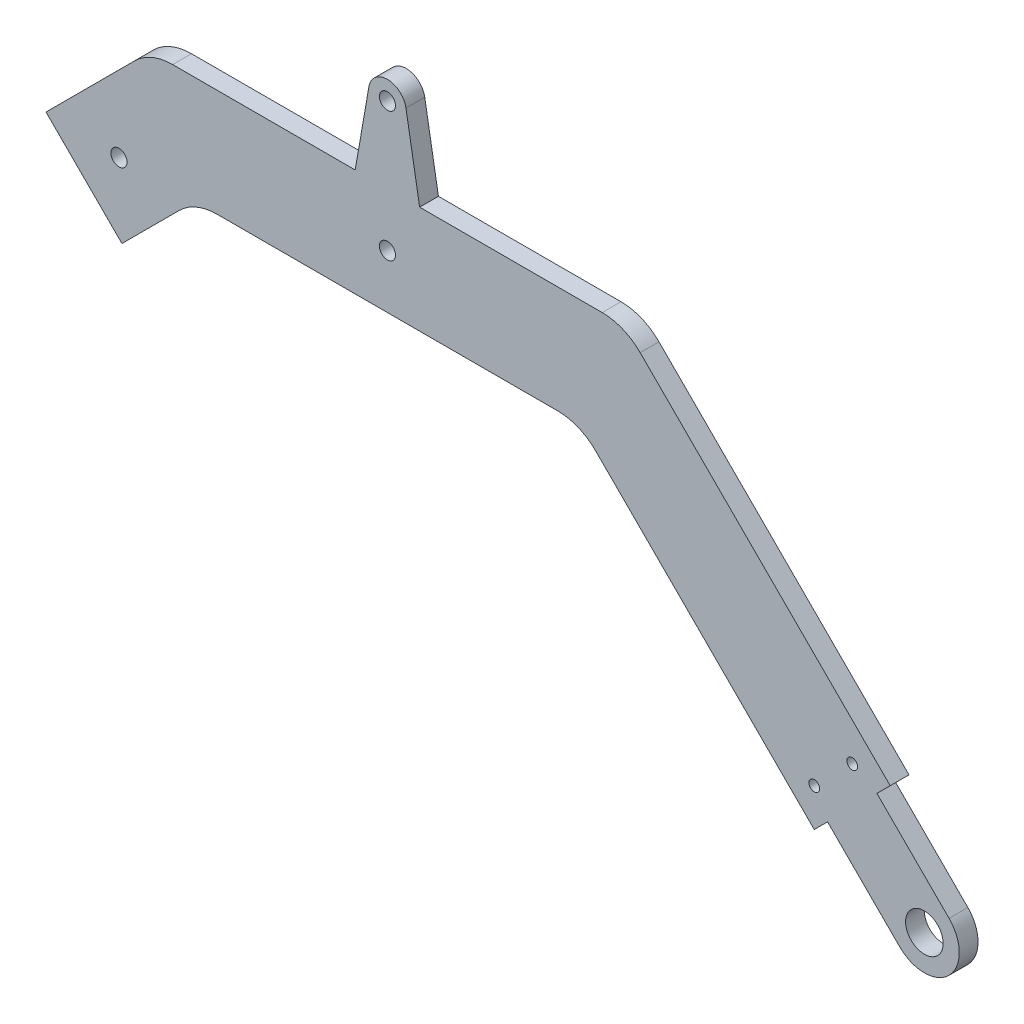
ISO-10303-21;
HEADER;
FILE_DESCRIPTION(('STEP AP214'),'2;1');
FILE_NAME('part.step','',(''),(''),'','','');
FILE_SCHEMA(('AUTOMOTIVE_DESIGN { 1 0 10303 214 1 1 1 1 }'));
ENDSEC;
DATA;
#1=APPLICATION_CONTEXT('core data for automotive mechanical design processes');
#2=APPLICATION_PROTOCOL_DEFINITION('international standard','automotive_design',2000,#1);
#3=PRODUCT_CONTEXT('',#1,'mechanical');
#4=PRODUCT('Part','Part','',(#3));
#5=PRODUCT_RELATED_PRODUCT_CATEGORY('part','',(#4));
#6=PRODUCT_DEFINITION_FORMATION('','',#4);
#7=PRODUCT_DEFINITION_CONTEXT('part definition',#1,'design');
#8=PRODUCT_DEFINITION('design','',#6,#7);
#9=PRODUCT_DEFINITION_SHAPE('','',#8);
#10=(LENGTH_UNIT() NAMED_UNIT(*) SI_UNIT(.MILLI.,.METRE.));
#11=(NAMED_UNIT(*) PLANE_ANGLE_UNIT() SI_UNIT($,.RADIAN.));
#12=(NAMED_UNIT(*) SI_UNIT($,.STERADIAN.) SOLID_ANGLE_UNIT());
#13=UNCERTAINTY_MEASURE_WITH_UNIT(LENGTH_MEASURE(1.E-05),#10,'distance_accuracy_value','');
#14=(GEOMETRIC_REPRESENTATION_CONTEXT(3) GLOBAL_UNCERTAINTY_ASSIGNED_CONTEXT((#13)) GLOBAL_UNIT_ASSIGNED_CONTEXT((#10,
#11,#12)) REPRESENTATION_CONTEXT('',''));
#15=CARTESIAN_POINT('',(0.,0.,0.));
#16=DIRECTION('',(0.,0.,1.));
#17=DIRECTION('',(1.,0.,0.));
#18=AXIS2_PLACEMENT_3D('',#15,#16,#17);
#19=CARTESIAN_POINT('',(100.,0.,3.5));
#20=DIRECTION('',(0.,0.,-1.));
#21=DIRECTION('',(-1.,0.,0.));
#22=AXIS2_PLACEMENT_3D('',#19,#20,#21);
#23=PLANE('',#22);
#24=DIRECTION('',(-1.,0.,0.));
#25=VECTOR('',#24,1.);
#26=CARTESIAN_POINT('',(-5.9999999999994,70.0000000000002,3.5));
#27=LINE('',#26,#25);
#28=CARTESIAN_POINT('',(-5.9999999999994,70.0000000000002,3.5));
#29=VERTEX_POINT('',#28);
#30=CARTESIAN_POINT('',(-39.9999999999999,70.,3.5));
#31=VERTEX_POINT('',#30);
#32=EDGE_CURVE('E353',#29,#31,#27,.T.);
#33=ORIENTED_EDGE('',*,*,#32,.T.);
#34=CARTESIAN_POINT('',(-39.9999999999999,60.,3.5));
#35=DIRECTION('',(0.,0.,-1.));
#36=DIRECTION('',(-1.,0.,0.));
#37=AXIS2_PLACEMENT_3D('',#34,#35,#36);
#38=CIRCLE('',#37,10.);
#39=CARTESIAN_POINT('',(-47.0710678118653,67.0710678118655,3.5));
#40=VERTEX_POINT('',#39);
#41=EDGE_CURVE('E219',#31,#40,#38,.F.);
#42=ORIENTED_EDGE('',*,*,#41,.T.);
#43=DIRECTION('',(-0.707106781186551,-0.707106781186544,0.));
#44=VECTOR('',#43,1.);
#45=CARTESIAN_POINT('',(-44.1421356237308,69.9999999999999,3.5));
#46=LINE('',#45,#44);
#47=CARTESIAN_POINT('',(-63.5875721063611,50.5545635173699,3.5));
#48=VERTEX_POINT('',#47);
#49=EDGE_CURVE('E351',#40,#48,#46,.T.);
#50=ORIENTED_EDGE('',*,*,#49,.T.);
#51=DIRECTION('',(0.707106781186547,-0.707106781186548,0.));
#52=VECTOR('',#51,1.);
#53=CARTESIAN_POINT('',(-63.5875721063611,50.5545635173699,3.5));
#54=LINE('',#53,#52);
#55=CARTESIAN_POINT('',(-49.4454364826301,36.4124278936389,3.5));
#56=VERTEX_POINT('',#55);
#57=EDGE_CURVE('E264',#48,#56,#54,.T.);
#58=ORIENTED_EDGE('',*,*,#57,.T.);
#59=DIRECTION('',(0.707106781186553,0.707106781186542,0.));
#60=VECTOR('',#59,1.);
#61=CARTESIAN_POINT('',(-49.4454364826301,36.4124278936389,3.5));
#62=LINE('',#61,#60);
#63=CARTESIAN_POINT('',(-38.7867965644034,47.0710678118655,3.5));
#64=VERTEX_POINT('',#63);
#65=EDGE_CURVE('E256',#56,#64,#62,.T.);
#66=ORIENTED_EDGE('',*,*,#65,.T.);
#67=CARTESIAN_POINT('',(-31.715728752538,39.9999999999999,3.5));
#68=DIRECTION('',(0.,0.,-1.));
#69=DIRECTION('',(-1.,0.,0.));
#70=AXIS2_PLACEMENT_3D('',#67,#68,#69);
#71=CIRCLE('',#70,10.);
#72=CARTESIAN_POINT('',(-31.715728752538,49.9999999999999,3.5));
#73=VERTEX_POINT('',#72);
#74=EDGE_CURVE('E11',#64,#73,#71,.T.);
#75=ORIENTED_EDGE('',*,*,#74,.T.);
#76=DIRECTION('',(1.,0.,0.));
#77=VECTOR('',#76,1.);
#78=CARTESIAN_POINT('',(-35.8578643762689,49.9999999999999,3.5));
#79=LINE('',#78,#77);
#80=CARTESIAN_POINT('',(31.7157287525379,49.9999999999999,3.5));
#81=VERTEX_POINT('',#80);
#82=EDGE_CURVE('E254',#73,#81,#79,.T.);
#83=ORIENTED_EDGE('',*,*,#82,.T.);
#84=CARTESIAN_POINT('',(31.7157287525379,39.9999999999999,3.5));
#85=DIRECTION('',(0.,0.,-1.));
#86=DIRECTION('',(-1.,0.,0.));
#87=AXIS2_PLACEMENT_3D('',#84,#85,#86);
#88=CIRCLE('',#87,10.);
#89=CARTESIAN_POINT('',(38.7867965644033,47.0710678118655,3.5));
#90=VERTEX_POINT('',#89);
#91=EDGE_CURVE('E226',#81,#90,#88,.T.);
#92=ORIENTED_EDGE('',*,*,#91,.T.);
#93=DIRECTION('',(0.707106781186555,-0.70710678118654,0.));
#94=VECTOR('',#93,1.);
#95=CARTESIAN_POINT('',(35.8578643762688,49.9999999999999,3.5));
#96=LINE('',#95,#94);
#97=CARTESIAN_POINT('',(79.4939033455905,6.36396103067924,3.5));
#98=VERTEX_POINT('',#97);
#99=EDGE_CURVE('E260',#90,#98,#96,.T.);
#100=ORIENTED_EDGE('',*,*,#99,.T.);
#101=DIRECTION('',(0.707106781186545,0.70710678118655,0.));
#102=VECTOR('',#101,1.);
#103=CARTESIAN_POINT('',(79.4939033455905,6.36396103067924,3.5));
#104=LINE('',#103,#102);
#105=CARTESIAN_POINT('',(81.968777079743,8.83883476483185,3.5));
#106=VERTEX_POINT('',#105);
#107=EDGE_CURVE('E262',#98,#106,#104,.T.);
#108=ORIENTED_EDGE('',*,*,#107,.T.);
#109=DIRECTION('',(0.707106781186548,-0.707106781186547,0.));
#110=VECTOR('',#109,1.);
#111=CARTESIAN_POINT('',(81.968777079743,8.83883476483185,3.5));
#112=LINE('',#111,#110);
#113=CARTESIAN_POINT('',(95.4038059222874,-4.59619407771256,3.5));
#114=VERTEX_POINT('',#113);
#115=EDGE_CURVE('E269',#106,#114,#112,.T.);
#116=ORIENTED_EDGE('',*,*,#115,.T.);
#117=CARTESIAN_POINT('',(100.,0.,3.5));
#118=DIRECTION('',(0.,0.,1.));
#119=DIRECTION('',(-1.,0.,0.));
#120=AXIS2_PLACEMENT_3D('',#117,#118,#119);
#121=CIRCLE('',#120,6.5);
#122=CARTESIAN_POINT('',(104.596194077713,4.59619407771256,3.5));
#123=VERTEX_POINT('',#122);
#124=EDGE_CURVE('E271',#114,#123,#121,.T.);
#125=ORIENTED_EDGE('',*,*,#124,.T.);
#126=DIRECTION('',(-0.707106781186548,0.707106781186547,0.));
#127=VECTOR('',#126,1.);
#128=CARTESIAN_POINT('',(91.1611652351682,18.031222920257,3.5));
#129=LINE('',#128,#127);
#130=CARTESIAN_POINT('',(91.1611652351682,18.031222920257,3.5));
#131=VERTEX_POINT('',#130);
#132=EDGE_CURVE('E273',#123,#131,#129,.T.);
#133=ORIENTED_EDGE('',*,*,#132,.T.);
#134=DIRECTION('',(0.707106781186551,0.707106781186544,0.));
#135=VECTOR('',#134,1.);
#136=CARTESIAN_POINT('',(93.6360389693214,20.5060966544102,3.5));
#137=LINE('',#136,#135);
#138=CARTESIAN_POINT('',(93.6360389693214,20.5060966544102,3.5));
#139=VERTEX_POINT('',#138);
#140=EDGE_CURVE('E275',#131,#139,#137,.T.);
#141=ORIENTED_EDGE('',*,*,#140,.T.);
#142=DIRECTION('',(-0.707106781186554,0.707106781186541,0.));
#143=VECTOR('',#142,1.);
#144=CARTESIAN_POINT('',(93.6360389693214,20.5060966544102,3.5));
#145=LINE('',#144,#143);
#146=CARTESIAN_POINT('',(47.0710678118652,67.0710678118655,3.5));
#147=VERTEX_POINT('',#146);
#148=EDGE_CURVE('E277',#139,#147,#145,.T.);
#149=ORIENTED_EDGE('',*,*,#148,.T.);
#150=CARTESIAN_POINT('',(39.9999999999998,60.,3.5));
#151=DIRECTION('',(0.,0.,-1.));
#152=DIRECTION('',(-1.,0.,0.));
#153=AXIS2_PLACEMENT_3D('',#150,#151,#152);
#154=CIRCLE('',#153,10.);
#155=CARTESIAN_POINT('',(39.9999999999999,70.,3.5));
#156=VERTEX_POINT('',#155);
#157=EDGE_CURVE('E56',#147,#156,#154,.F.);
#158=ORIENTED_EDGE('',*,*,#157,.T.);
#159=DIRECTION('',(-1.,0.,0.));
#160=VECTOR('',#159,1.);
#161=CARTESIAN_POINT('',(6.00000000000032,70.0000000000002,3.5));
#162=LINE('',#161,#160);
#163=CARTESIAN_POINT('',(6.00000000000032,70.0000000000002,3.5));
#164=VERTEX_POINT('',#163);
#165=EDGE_CURVE('E169',#156,#164,#162,.T.);
#166=ORIENTED_EDGE('',*,*,#165,.T.);
#167=DIRECTION('',(-0.170809123568688,0.985304137465025,0.));
#168=VECTOR('',#167,1.);
#169=CARTESIAN_POINT('',(6.00000000000032,70.0000000000002,3.5));
#170=LINE('',#169,#168);
#171=CARTESIAN_POINT('',(3.44856448112818,84.7178319324906,3.5));
#172=VERTEX_POINT('',#171);
#173=EDGE_CURVE('E173',#164,#172,#170,.T.);
#174=ORIENTED_EDGE('',*,*,#173,.T.);
#175=CARTESIAN_POINT('',(5.96744875736022E-13,84.1200000000002,3.5));
#176=DIRECTION('',(0.,0.,1.));
#177=DIRECTION('',(-1.,0.,0.));
#178=AXIS2_PLACEMENT_3D('',#175,#176,#177);
#179=CIRCLE('',#178,3.5);
#180=CARTESIAN_POINT('',(-3.44856448112698,84.7178319324906,3.5));
#181=VERTEX_POINT('',#180);
#182=EDGE_CURVE('E188',#172,#181,#179,.T.);
#183=ORIENTED_EDGE('',*,*,#182,.T.);
#184=DIRECTION('',(-0.170809123568706,-0.985304137465022,0.));
#185=VECTOR('',#184,1.);
#186=CARTESIAN_POINT('',(-5.9999999999994,70.0000000000002,3.5));
#187=LINE('',#186,#185);
#188=EDGE_CURVE('E338',#181,#29,#187,.T.);
#189=ORIENTED_EDGE('',*,*,#188,.T.);
#190=EDGE_LOOP('',(#33,#42,#50,#58,#66,#75,#83,#92,#100,#108,#116,#125,#133,#141,#149,#158,#166,
#174,#183,#189));
#191=FACE_BOUND('',#190,.T.);
#192=CARTESIAN_POINT('',(86.5649711574559,20.5060966544102,3.5));
#193=DIRECTION('',(0.,0.,1.));
#194=DIRECTION('',(1.,0.,0.));
#195=AXIS2_PLACEMENT_3D('',#192,#193,#194);
#196=CIRCLE('',#195,0.999999999999998);
#197=CARTESIAN_POINT('',(87.5649711574559,20.5060966544102,3.5));
#198=VERTEX_POINT('',#197);
#199=EDGE_CURVE('E282',#198,#198,#196,.T.);
#200=ORIENTED_EDGE('',*,*,#199,.F.);
#201=EDGE_LOOP('',(#200));
#202=FACE_BOUND('',#201,.T.);
#203=CARTESIAN_POINT('',(79.4939033455905,13.4350288425447,3.5));
#204=DIRECTION('',(0.,0.,1.));
#205=DIRECTION('',(1.,0.,0.));
#206=AXIS2_PLACEMENT_3D('',#203,#204,#205);
#207=CIRCLE('',#206,0.999999999999998);
#208=CARTESIAN_POINT('',(80.4939033455905,13.4350288425447,3.5));
#209=VERTEX_POINT('',#208);
#210=EDGE_CURVE('E365',#209,#209,#207,.T.);
#211=ORIENTED_EDGE('',*,*,#210,.F.);
#212=EDGE_LOOP('',(#211));
#213=FACE_BOUND('',#212,.T.);
#214=CARTESIAN_POINT('',(100.,0.,3.5));
#215=DIRECTION('',(0.,0.,1.));
#216=DIRECTION('',(1.,0.,0.));
#217=AXIS2_PLACEMENT_3D('',#214,#215,#216);
#218=CIRCLE('',#217,3.50000000000001);
#219=CARTESIAN_POINT('',(103.5,0.,3.5));
#220=VERTEX_POINT('',#219);
#221=EDGE_CURVE('E371',#220,#220,#218,.T.);
#222=ORIENTED_EDGE('',*,*,#221,.F.);
#223=EDGE_LOOP('',(#222));
#224=FACE_BOUND('',#223,.T.);
#225=CARTESIAN_POINT('',(5.96744875736022E-13,84.1200000000002,3.5));
#226=DIRECTION('',(0.,0.,1.));
#227=DIRECTION('',(1.,0.,0.));
#228=AXIS2_PLACEMENT_3D('',#225,#226,#227);
#229=CIRCLE('',#228,1.5);
#230=CARTESIAN_POINT('',(1.5000000000006,84.1200000000002,3.5));
#231=VERTEX_POINT('',#230);
#232=EDGE_CURVE('E377',#231,#231,#229,.T.);
#233=ORIENTED_EDGE('',*,*,#232,.F.);
#234=EDGE_LOOP('',(#233));
#235=FACE_BOUND('',#234,.T.);
#236=CARTESIAN_POINT('',(0.,60.0000000000002,3.5));
#237=DIRECTION('',(0.,0.,1.));
#238=DIRECTION('',(1.,0.,0.));
#239=AXIS2_PLACEMENT_3D('',#236,#237,#238);
#240=CIRCLE('',#239,1.5);
#241=CARTESIAN_POINT('',(1.49999999999997,60.0000000000002,3.5));
#242=VERTEX_POINT('',#241);
#243=EDGE_CURVE('E383',#242,#242,#240,.T.);
#244=ORIENTED_EDGE('',*,*,#243,.F.);
#245=EDGE_LOOP('',(#244));
#246=FACE_BOUND('',#245,.T.);
#247=CARTESIAN_POINT('',(-50.0000000000001,50.0000000000003,3.5));
#248=DIRECTION('',(0.,0.,1.));
#249=DIRECTION('',(1.,0.,0.));
#250=AXIS2_PLACEMENT_3D('',#247,#248,#249);
#251=CIRCLE('',#250,1.5);
#252=CARTESIAN_POINT('',(-48.5000000000001,50.0000000000003,3.5));
#253=VERTEX_POINT('',#252);
#254=EDGE_CURVE('E389',#253,#253,#251,.T.);
#255=ORIENTED_EDGE('',*,*,#254,.F.);
#256=EDGE_LOOP('',(#255));
#257=FACE_BOUND('',#256,.T.);
#258=ADVANCED_FACE('F34',(#191,#202,#213,#224,#235,#246,#257),#23,.F.);
#259=CARTESIAN_POINT('',(100.,0.,0.));
#260=DIRECTION('',(0.,0.,-1.));
#261=DIRECTION('',(-1.,0.,0.));
#262=AXIS2_PLACEMENT_3D('',#259,#260,#261);
#263=PLANE('',#262);
#264=CARTESIAN_POINT('',(0.,60.0000000000002,0.));
#265=DIRECTION('',(0.,0.,1.));
#266=DIRECTION('',(1.,0.,0.));
#267=AXIS2_PLACEMENT_3D('',#264,#265,#266);
#268=CIRCLE('',#267,1.5);
#269=CARTESIAN_POINT('',(1.49999999999997,60.0000000000002,0.));
#270=VERTEX_POINT('',#269);
#271=EDGE_CURVE('E386',#270,#270,#268,.T.);
#272=ORIENTED_EDGE('',*,*,#271,.T.);
#273=EDGE_LOOP('',(#272));
#274=FACE_BOUND('',#273,.T.);
#275=CARTESIAN_POINT('',(100.,0.,0.));
#276=DIRECTION('',(0.,0.,1.));
#277=DIRECTION('',(1.,0.,0.));
#278=AXIS2_PLACEMENT_3D('',#275,#276,#277);
#279=CIRCLE('',#278,3.50000000000001);
#280=CARTESIAN_POINT('',(103.5,0.,0.));
#281=VERTEX_POINT('',#280);
#282=EDGE_CURVE('E374',#281,#281,#279,.T.);
#283=ORIENTED_EDGE('',*,*,#282,.T.);
#284=EDGE_LOOP('',(#283));
#285=FACE_BOUND('',#284,.T.);
#286=CARTESIAN_POINT('',(86.5649711574559,20.5060966544102,0.));
#287=DIRECTION('',(0.,0.,1.));
#288=DIRECTION('',(1.,0.,0.));
#289=AXIS2_PLACEMENT_3D('',#286,#287,#288);
#290=CIRCLE('',#289,0.999999999999998);
#291=CARTESIAN_POINT('',(87.5649711574559,20.5060966544102,0.));
#292=VERTEX_POINT('',#291);
#293=EDGE_CURVE('E362',#292,#292,#290,.T.);
#294=ORIENTED_EDGE('',*,*,#293,.T.);
#295=EDGE_LOOP('',(#294));
#296=FACE_BOUND('',#295,.T.);
#297=DIRECTION('',(-0.707106781186551,-0.707106781186544,0.));
#298=VECTOR('',#297,1.);
#299=CARTESIAN_POINT('',(-44.1421356237308,69.9999999999999,0.));
#300=LINE('',#299,#298);
#301=CARTESIAN_POINT('',(-47.0710678118653,67.0710678118655,0.));
#302=VERTEX_POINT('',#301);
#303=CARTESIAN_POINT('',(-63.5875721063611,50.5545635173699,0.));
#304=VERTEX_POINT('',#303);
#305=EDGE_CURVE('E291',#302,#304,#300,.T.);
#306=ORIENTED_EDGE('',*,*,#305,.F.);
#307=CARTESIAN_POINT('',(-39.9999999999999,60.,0.));
#308=DIRECTION('',(0.,0.,-1.));
#309=DIRECTION('',(-1.,0.,0.));
#310=AXIS2_PLACEMENT_3D('',#307,#308,#309);
#311=CIRCLE('',#310,10.);
#312=CARTESIAN_POINT('',(-39.9999999999999,70.,0.));
#313=VERTEX_POINT('',#312);
#314=EDGE_CURVE('E214',#302,#313,#311,.T.);
#315=ORIENTED_EDGE('',*,*,#314,.T.);
#316=DIRECTION('',(-1.,0.,0.));
#317=VECTOR('',#316,1.);
#318=CARTESIAN_POINT('',(-5.9999999999994,70.0000000000002,0.));
#319=LINE('',#318,#317);
#320=CARTESIAN_POINT('',(-5.9999999999994,70.0000000000002,0.));
#321=VERTEX_POINT('',#320);
#322=EDGE_CURVE('E288',#321,#313,#319,.T.);
#323=ORIENTED_EDGE('',*,*,#322,.F.);
#324=DIRECTION('',(-0.170809123568706,-0.985304137465022,0.));
#325=VECTOR('',#324,1.);
#326=CARTESIAN_POINT('',(-5.9999999999994,70.0000000000002,0.));
#327=LINE('',#326,#325);
#328=CARTESIAN_POINT('',(-3.44856448112698,84.7178319324906,0.));
#329=VERTEX_POINT('',#328);
#330=EDGE_CURVE('E286',#329,#321,#327,.T.);
#331=ORIENTED_EDGE('',*,*,#330,.F.);
#332=CARTESIAN_POINT('',(5.96744875736022E-13,84.1200000000002,0.));
#333=DIRECTION('',(0.,0.,1.));
#334=DIRECTION('',(-1.,0.,0.));
#335=AXIS2_PLACEMENT_3D('',#332,#333,#334);
#336=CIRCLE('',#335,3.5);
#337=CARTESIAN_POINT('',(3.44856448112818,84.7178319324906,0.));
#338=VERTEX_POINT('',#337);
#339=EDGE_CURVE('E284',#338,#329,#336,.T.);
#340=ORIENTED_EDGE('',*,*,#339,.F.);
#341=DIRECTION('',(-0.170809123568688,0.985304137465025,0.));
#342=VECTOR('',#341,1.);
#343=CARTESIAN_POINT('',(6.00000000000032,70.0000000000002,0.));
#344=LINE('',#343,#342);
#345=CARTESIAN_POINT('',(6.00000000000032,70.0000000000002,0.));
#346=VERTEX_POINT('',#345);
#347=EDGE_CURVE('E281',#346,#338,#344,.T.);
#348=ORIENTED_EDGE('',*,*,#347,.F.);
#349=DIRECTION('',(-1.,0.,0.));
#350=VECTOR('',#349,1.);
#351=CARTESIAN_POINT('',(6.00000000000032,70.0000000000002,0.));
#352=LINE('',#351,#350);
#353=CARTESIAN_POINT('',(39.9999999999999,70.,0.));
#354=VERTEX_POINT('',#353);
#355=EDGE_CURVE('E192',#354,#346,#352,.T.);
#356=ORIENTED_EDGE('',*,*,#355,.F.);
#357=CARTESIAN_POINT('',(39.9999999999998,60.,0.));
#358=DIRECTION('',(0.,0.,-1.));
#359=DIRECTION('',(-1.,0.,0.));
#360=AXIS2_PLACEMENT_3D('',#357,#358,#359);
#361=CIRCLE('',#360,10.);
#362=CARTESIAN_POINT('',(47.0710678118652,67.0710678118655,0.));
#363=VERTEX_POINT('',#362);
#364=EDGE_CURVE('E212',#354,#363,#361,.T.);
#365=ORIENTED_EDGE('',*,*,#364,.T.);
#366=DIRECTION('',(-0.707106781186554,0.707106781186541,0.));
#367=VECTOR('',#366,1.);
#368=CARTESIAN_POINT('',(93.6360389693214,20.5060966544102,0.));
#369=LINE('',#368,#367);
#370=CARTESIAN_POINT('',(93.6360389693214,20.5060966544102,0.));
#371=VERTEX_POINT('',#370);
#372=EDGE_CURVE('E179',#371,#363,#369,.T.);
#373=ORIENTED_EDGE('',*,*,#372,.F.);
#374=DIRECTION('',(0.707106781186551,0.707106781186544,0.));
#375=VECTOR('',#374,1.);
#376=CARTESIAN_POINT('',(93.6360389693214,20.5060966544102,0.));
#377=LINE('',#376,#375);
#378=CARTESIAN_POINT('',(91.1611652351682,18.031222920257,0.));
#379=VERTEX_POINT('',#378);
#380=EDGE_CURVE('E305',#379,#371,#377,.T.);
#381=ORIENTED_EDGE('',*,*,#380,.F.);
#382=DIRECTION('',(-0.707106781186548,0.707106781186547,0.));
#383=VECTOR('',#382,1.);
#384=CARTESIAN_POINT('',(91.1611652351682,18.031222920257,0.));
#385=LINE('',#384,#383);
#386=CARTESIAN_POINT('',(104.596194077713,4.59619407771256,0.));
#387=VERTEX_POINT('',#386);
#388=EDGE_CURVE('E303',#387,#379,#385,.T.);
#389=ORIENTED_EDGE('',*,*,#388,.F.);
#390=CARTESIAN_POINT('',(100.,0.,0.));
#391=DIRECTION('',(0.,0.,1.));
#392=DIRECTION('',(-1.,0.,0.));
#393=AXIS2_PLACEMENT_3D('',#390,#391,#392);
#394=CIRCLE('',#393,6.5);
#395=CARTESIAN_POINT('',(95.4038059222874,-4.59619407771256,0.));
#396=VERTEX_POINT('',#395);
#397=EDGE_CURVE('E301',#396,#387,#394,.T.);
#398=ORIENTED_EDGE('',*,*,#397,.F.);
#399=DIRECTION('',(0.707106781186548,-0.707106781186547,0.));
#400=VECTOR('',#399,1.);
#401=CARTESIAN_POINT('',(81.968777079743,8.83883476483185,0.));
#402=LINE('',#401,#400);
#403=CARTESIAN_POINT('',(81.968777079743,8.83883476483185,0.));
#404=VERTEX_POINT('',#403);
#405=EDGE_CURVE('E299',#404,#396,#402,.T.);
#406=ORIENTED_EDGE('',*,*,#405,.F.);
#407=DIRECTION('',(0.707106781186545,0.70710678118655,0.));
#408=VECTOR('',#407,1.);
#409=CARTESIAN_POINT('',(79.4939033455905,6.36396103067924,0.));
#410=LINE('',#409,#408);
#411=CARTESIAN_POINT('',(79.4939033455905,6.36396103067924,0.));
#412=VERTEX_POINT('',#411);
#413=EDGE_CURVE('E297',#412,#404,#410,.T.);
#414=ORIENTED_EDGE('',*,*,#413,.F.);
#415=DIRECTION('',(0.707106781186555,-0.70710678118654,0.));
#416=VECTOR('',#415,1.);
#417=CARTESIAN_POINT('',(35.8578643762688,49.9999999999999,0.));
#418=LINE('',#417,#416);
#419=CARTESIAN_POINT('',(38.7867965644033,47.0710678118655,0.));
#420=VERTEX_POINT('',#419);
#421=EDGE_CURVE('E295',#420,#412,#418,.T.);
#422=ORIENTED_EDGE('',*,*,#421,.F.);
#423=CARTESIAN_POINT('',(31.7157287525379,39.9999999999999,0.));
#424=DIRECTION('',(0.,0.,-1.));
#425=DIRECTION('',(-1.,0.,0.));
#426=AXIS2_PLACEMENT_3D('',#423,#424,#425);
#427=CIRCLE('',#426,10.);
#428=CARTESIAN_POINT('',(31.7157287525379,49.9999999999999,0.));
#429=VERTEX_POINT('',#428);
#430=EDGE_CURVE('E224',#420,#429,#427,.F.);
#431=ORIENTED_EDGE('',*,*,#430,.T.);
#432=DIRECTION('',(1.,0.,0.));
#433=VECTOR('',#432,1.);
#434=CARTESIAN_POINT('',(-35.8578643762689,49.9999999999999,0.));
#435=LINE('',#434,#433);
#436=CARTESIAN_POINT('',(-31.715728752538,49.9999999999999,0.));
#437=VERTEX_POINT('',#436);
#438=EDGE_CURVE('E237',#437,#429,#435,.T.);
#439=ORIENTED_EDGE('',*,*,#438,.F.);
#440=CARTESIAN_POINT('',(-31.715728752538,39.9999999999999,0.));
#441=DIRECTION('',(0.,0.,-1.));
#442=DIRECTION('',(-1.,0.,0.));
#443=AXIS2_PLACEMENT_3D('',#440,#441,#442);
#444=CIRCLE('',#443,10.);
#445=CARTESIAN_POINT('',(-38.7867965644034,47.0710678118655,0.));
#446=VERTEX_POINT('',#445);
#447=EDGE_CURVE('E42',#437,#446,#444,.F.);
#448=ORIENTED_EDGE('',*,*,#447,.T.);
#449=DIRECTION('',(0.707106781186553,0.707106781186542,0.));
#450=VECTOR('',#449,1.);
#451=CARTESIAN_POINT('',(-49.4454364826301,36.4124278936389,0.));
#452=LINE('',#451,#450);
#453=CARTESIAN_POINT('',(-49.4454364826301,36.4124278936389,0.));
#454=VERTEX_POINT('',#453);
#455=EDGE_CURVE('E235',#454,#446,#452,.T.);
#456=ORIENTED_EDGE('',*,*,#455,.F.);
#457=DIRECTION('',(0.707106781186547,-0.707106781186548,0.));
#458=VECTOR('',#457,1.);
#459=CARTESIAN_POINT('',(-63.5875721063611,50.5545635173699,0.));
#460=LINE('',#459,#458);
#461=EDGE_CURVE('E248',#304,#454,#460,.T.);
#462=ORIENTED_EDGE('',*,*,#461,.F.);
#463=EDGE_LOOP('',(#306,#315,#323,#331,#340,#348,#356,#365,#373,#381,#389,#398,#406,#414,#422,
#431,#439,#448,#456,#462));
#464=FACE_BOUND('',#463,.T.);
#465=CARTESIAN_POINT('',(79.4939033455905,13.4350288425447,0.));
#466=DIRECTION('',(0.,0.,1.));
#467=DIRECTION('',(1.,0.,0.));
#468=AXIS2_PLACEMENT_3D('',#465,#466,#467);
#469=CIRCLE('',#468,0.999999999999998);
#470=CARTESIAN_POINT('',(80.4939033455905,13.4350288425447,0.));
#471=VERTEX_POINT('',#470);
#472=EDGE_CURVE('E368',#471,#471,#469,.T.);
#473=ORIENTED_EDGE('',*,*,#472,.T.);
#474=EDGE_LOOP('',(#473));
#475=FACE_BOUND('',#474,.T.);
#476=CARTESIAN_POINT('',(5.96744875736022E-13,84.1200000000002,0.));
#477=DIRECTION('',(0.,0.,1.));
#478=DIRECTION('',(1.,0.,0.));
#479=AXIS2_PLACEMENT_3D('',#476,#477,#478);
#480=CIRCLE('',#479,1.5);
#481=CARTESIAN_POINT('',(1.5000000000006,84.1200000000002,0.));
#482=VERTEX_POINT('',#481);
#483=EDGE_CURVE('E380',#482,#482,#480,.T.);
#484=ORIENTED_EDGE('',*,*,#483,.T.);
#485=EDGE_LOOP('',(#484));
#486=FACE_BOUND('',#485,.T.);
#487=CARTESIAN_POINT('',(-50.0000000000001,50.0000000000003,0.));
#488=DIRECTION('',(0.,0.,1.));
#489=DIRECTION('',(1.,0.,0.));
#490=AXIS2_PLACEMENT_3D('',#487,#488,#489);
#491=CIRCLE('',#490,1.5);
#492=CARTESIAN_POINT('',(-48.5000000000001,50.0000000000003,0.));
#493=VERTEX_POINT('',#492);
#494=EDGE_CURVE('E392',#493,#493,#491,.T.);
#495=ORIENTED_EDGE('',*,*,#494,.T.);
#496=EDGE_LOOP('',(#495));
#497=FACE_BOUND('',#496,.T.);
#498=ADVANCED_FACE('F232',(#274,#285,#296,#464,#475,#486,#497),#263,.T.);
#499=CARTESIAN_POINT('',(6.00000000000032,70.0000000000002,3.5));
#500=DIRECTION('',(0.,-1.,0.));
#501=DIRECTION('',(1.,0.,0.));
#502=AXIS2_PLACEMENT_3D('',#499,#500,#501);
#503=PLANE('',#502);
#504=ORIENTED_EDGE('',*,*,#165,.F.);
#505=DIRECTION('',(0.,0.,-1.));
#506=VECTOR('',#505,1.);
#507=CARTESIAN_POINT('',(39.9999999999999,70.,3.5));
#508=LINE('',#507,#506);
#509=EDGE_CURVE('E221',#156,#354,#508,.T.);
#510=ORIENTED_EDGE('',*,*,#509,.T.);
#511=ORIENTED_EDGE('',*,*,#355,.T.);
#512=DIRECTION('',(0.,0.,-1.));
#513=VECTOR('',#512,1.);
#514=CARTESIAN_POINT('',(6.00000000000032,70.0000000000002,3.5));
#515=LINE('',#514,#513);
#516=EDGE_CURVE('E184',#164,#346,#515,.T.);
#517=ORIENTED_EDGE('',*,*,#516,.F.);
#518=EDGE_LOOP('',(#504,#510,#511,#517));
#519=FACE_BOUND('',#518,.T.);
#520=ADVANCED_FACE('F190',(#519),#503,.F.);
#521=CARTESIAN_POINT('',(6.00000000000032,70.0000000000002,3.5));
#522=DIRECTION('',(-0.985304137465025,-0.170809123568688,0.));
#523=DIRECTION('',(0.170809123568688,-0.985304137465025,0.));
#524=AXIS2_PLACEMENT_3D('',#521,#522,#523);
#525=PLANE('',#524);
#526=ORIENTED_EDGE('',*,*,#347,.T.);
#527=DIRECTION('',(0.,0.,-1.));
#528=VECTOR('',#527,1.);
#529=CARTESIAN_POINT('',(3.44856448112818,84.7178319324906,3.5));
#530=LINE('',#529,#528);
#531=EDGE_CURVE('E186',#172,#338,#530,.T.);
#532=ORIENTED_EDGE('',*,*,#531,.F.);
#533=ORIENTED_EDGE('',*,*,#173,.F.);
#534=ORIENTED_EDGE('',*,*,#516,.T.);
#535=EDGE_LOOP('',(#526,#532,#533,#534));
#536=FACE_BOUND('',#535,.T.);
#537=ADVANCED_FACE('F183',(#536),#525,.F.);
#538=CARTESIAN_POINT('',(5.96744875736022E-13,84.1200000000002,3.5));
#539=DIRECTION('',(0.,0.,-1.));
#540=DIRECTION('',(-1.,0.,0.));
#541=AXIS2_PLACEMENT_3D('',#538,#539,#540);
#542=CYLINDRICAL_SURFACE('',#541,3.5);
#543=ORIENTED_EDGE('',*,*,#339,.T.);
#544=DIRECTION('',(0.,0.,-1.));
#545=VECTOR('',#544,1.);
#546=CARTESIAN_POINT('',(-3.44856448112698,84.7178319324906,3.5));
#547=LINE('',#546,#545);
#548=EDGE_CURVE('E199',#181,#329,#547,.T.);
#549=ORIENTED_EDGE('',*,*,#548,.F.);
#550=ORIENTED_EDGE('',*,*,#182,.F.);
#551=ORIENTED_EDGE('',*,*,#531,.T.);
#552=EDGE_LOOP('',(#543,#549,#550,#551));
#553=FACE_BOUND('',#552,.T.);
#554=ADVANCED_FACE('F453',(#553),#542,.T.);
#555=CARTESIAN_POINT('',(-5.9999999999994,70.0000000000002,3.5));
#556=DIRECTION('',(0.985304137465022,-0.170809123568706,0.));
#557=DIRECTION('',(0.170809123568706,0.985304137465022,0.));
#558=AXIS2_PLACEMENT_3D('',#555,#556,#557);
#559=PLANE('',#558);
#560=ORIENTED_EDGE('',*,*,#330,.T.);
#561=DIRECTION('',(0.,0.,-1.));
#562=VECTOR('',#561,1.);
#563=CARTESIAN_POINT('',(-5.9999999999994,70.0000000000002,3.5));
#564=LINE('',#563,#562);
#565=EDGE_CURVE('E329',#29,#321,#564,.T.);
#566=ORIENTED_EDGE('',*,*,#565,.F.);
#567=ORIENTED_EDGE('',*,*,#188,.F.);
#568=ORIENTED_EDGE('',*,*,#548,.T.);
#569=EDGE_LOOP('',(#560,#566,#567,#568));
#570=FACE_BOUND('',#569,.T.);
#571=ADVANCED_FACE('F336',(#570),#559,.F.);
#572=CARTESIAN_POINT('',(-5.9999999999994,70.0000000000002,3.5));
#573=DIRECTION('',(0.,-1.,0.));
#574=DIRECTION('',(1.,0.,0.));
#575=AXIS2_PLACEMENT_3D('',#572,#573,#574);
#576=PLANE('',#575);
#577=ORIENTED_EDGE('',*,*,#322,.T.);
#578=DIRECTION('',(0.,0.,-1.));
#579=VECTOR('',#578,1.);
#580=CARTESIAN_POINT('',(-39.9999999999999,70.,3.5));
#581=LINE('',#580,#579);
#582=EDGE_CURVE('E216',#313,#31,#581,.F.);
#583=ORIENTED_EDGE('',*,*,#582,.T.);
#584=ORIENTED_EDGE('',*,*,#32,.F.);
#585=ORIENTED_EDGE('',*,*,#565,.T.);
#586=EDGE_LOOP('',(#577,#583,#584,#585));
#587=FACE_BOUND('',#586,.T.);
#588=ADVANCED_FACE('F344',(#587),#576,.F.);
#589=CARTESIAN_POINT('',(-44.1421356237308,69.9999999999999,3.5));
#590=DIRECTION('',(0.707106781186544,-0.707106781186551,0.));
#591=DIRECTION('',(0.707106781186551,0.707106781186544,0.));
#592=AXIS2_PLACEMENT_3D('',#589,#590,#591);
#593=PLANE('',#592);
#594=ORIENTED_EDGE('',*,*,#49,.F.);
#595=DIRECTION('',(0.,0.,-1.));
#596=VECTOR('',#595,1.);
#597=CARTESIAN_POINT('',(-47.0710678118653,67.0710678118655,3.5));
#598=LINE('',#597,#596);
#599=EDGE_CURVE('E209',#40,#302,#598,.T.);
#600=ORIENTED_EDGE('',*,*,#599,.T.);
#601=ORIENTED_EDGE('',*,*,#305,.T.);
#602=DIRECTION('',(0.,0.,-1.));
#603=VECTOR('',#602,1.);
#604=CARTESIAN_POINT('',(-63.5875721063611,50.5545635173699,3.5));
#605=LINE('',#604,#603);
#606=EDGE_CURVE('E326',#48,#304,#605,.T.);
#607=ORIENTED_EDGE('',*,*,#606,.F.);
#608=EDGE_LOOP('',(#594,#600,#601,#607));
#609=FACE_BOUND('',#608,.T.);
#610=ADVANCED_FACE('F355',(#609),#593,.F.);
#611=CARTESIAN_POINT('',(-63.5875721063611,50.5545635173699,3.5));
#612=DIRECTION('',(0.707106781186548,0.707106781186547,0.));
#613=DIRECTION('',(-0.707106781186547,0.707106781186548,0.));
#614=AXIS2_PLACEMENT_3D('',#611,#612,#613);
#615=PLANE('',#614);
#616=ORIENTED_EDGE('',*,*,#461,.T.);
#617=DIRECTION('',(0.,0.,-1.));
#618=VECTOR('',#617,1.);
#619=CARTESIAN_POINT('',(-49.4454364826301,36.4124278936389,3.5));
#620=LINE('',#619,#618);
#621=EDGE_CURVE('E247',#56,#454,#620,.T.);
#622=ORIENTED_EDGE('',*,*,#621,.F.);
#623=ORIENTED_EDGE('',*,*,#57,.F.);
#624=ORIENTED_EDGE('',*,*,#606,.T.);
#625=EDGE_LOOP('',(#616,#622,#623,#624));
#626=FACE_BOUND('',#625,.T.);
#627=ADVANCED_FACE('F443',(#626),#615,.F.);
#628=CARTESIAN_POINT('',(-49.4454364826301,36.4124278936389,3.5));
#629=DIRECTION('',(-0.707106781186542,0.707106781186553,0.));
#630=DIRECTION('',(-0.707106781186553,-0.707106781186542,0.));
#631=AXIS2_PLACEMENT_3D('',#628,#629,#630);
#632=PLANE('',#631);
#633=ORIENTED_EDGE('',*,*,#455,.T.);
#634=DIRECTION('',(0.,0.,-1.));
#635=VECTOR('',#634,1.);
#636=CARTESIAN_POINT('',(-38.7867965644034,47.0710678118655,3.5));
#637=LINE('',#636,#635);
#638=EDGE_CURVE('E207',#446,#64,#637,.F.);
#639=ORIENTED_EDGE('',*,*,#638,.T.);
#640=ORIENTED_EDGE('',*,*,#65,.F.);
#641=ORIENTED_EDGE('',*,*,#621,.T.);
#642=EDGE_LOOP('',(#633,#639,#640,#641));
#643=FACE_BOUND('',#642,.T.);
#644=ADVANCED_FACE('F243',(#643),#632,.F.);
#645=CARTESIAN_POINT('',(-35.8578643762689,49.9999999999999,3.5));
#646=DIRECTION('',(0.,1.,0.));
#647=DIRECTION('',(0.,0.,1.));
#648=AXIS2_PLACEMENT_3D('',#645,#646,#647);
#649=PLANE('',#648);
#650=ORIENTED_EDGE('',*,*,#438,.T.);
#651=DIRECTION('',(0.,0.,-1.));
#652=VECTOR('',#651,1.);
#653=CARTESIAN_POINT('',(31.7157287525379,49.9999999999999,3.5));
#654=LINE('',#653,#652);
#655=EDGE_CURVE('E205',#429,#81,#654,.F.);
#656=ORIENTED_EDGE('',*,*,#655,.T.);
#657=ORIENTED_EDGE('',*,*,#82,.F.);
#658=DIRECTION('',(0.,0.,-1.));
#659=VECTOR('',#658,1.);
#660=CARTESIAN_POINT('',(-31.715728752538,49.9999999999999,0.));
#661=LINE('',#660,#659);
#662=EDGE_CURVE('E197',#73,#437,#661,.T.);
#663=ORIENTED_EDGE('',*,*,#662,.T.);
#664=EDGE_LOOP('',(#650,#656,#657,#663));
#665=FACE_BOUND('',#664,.T.);
#666=ADVANCED_FACE('F258',(#665),#649,.F.);
#667=CARTESIAN_POINT('',(35.8578643762688,49.9999999999999,3.5));
#668=DIRECTION('',(0.70710678118654,0.707106781186555,0.));
#669=DIRECTION('',(-0.707106781186555,0.70710678118654,0.));
#670=AXIS2_PLACEMENT_3D('',#667,#668,#669);
#671=PLANE('',#670);
#672=ORIENTED_EDGE('',*,*,#99,.F.);
#673=DIRECTION('',(0.,0.,-1.));
#674=VECTOR('',#673,1.);
#675=CARTESIAN_POINT('',(38.7867965644033,47.0710678118655,0.));
#676=LINE('',#675,#674);
#677=EDGE_CURVE('E194',#90,#420,#676,.T.);
#678=ORIENTED_EDGE('',*,*,#677,.T.);
#679=ORIENTED_EDGE('',*,*,#421,.T.);
#680=DIRECTION('',(0.,0.,-1.));
#681=VECTOR('',#680,1.);
#682=CARTESIAN_POINT('',(79.4939033455905,6.36396103067924,3.5));
#683=LINE('',#682,#681);
#684=EDGE_CURVE('E322',#98,#412,#683,.T.);
#685=ORIENTED_EDGE('',*,*,#684,.F.);
#686=EDGE_LOOP('',(#672,#678,#679,#685));
#687=FACE_BOUND('',#686,.T.);
#688=ADVANCED_FACE('F434',(#687),#671,.F.);
#689=CARTESIAN_POINT('',(79.4939033455905,6.36396103067924,3.5));
#690=DIRECTION('',(-0.70710678118655,0.707106781186545,0.));
#691=DIRECTION('',(-0.707106781186545,-0.70710678118655,0.));
#692=AXIS2_PLACEMENT_3D('',#689,#690,#691);
#693=PLANE('',#692);
#694=ORIENTED_EDGE('',*,*,#413,.T.);
#695=DIRECTION('',(0.,0.,-1.));
#696=VECTOR('',#695,1.);
#697=CARTESIAN_POINT('',(81.968777079743,8.83883476483185,3.5));
#698=LINE('',#697,#696);
#699=EDGE_CURVE('E319',#106,#404,#698,.T.);
#700=ORIENTED_EDGE('',*,*,#699,.F.);
#701=ORIENTED_EDGE('',*,*,#107,.F.);
#702=ORIENTED_EDGE('',*,*,#684,.T.);
#703=EDGE_LOOP('',(#694,#700,#701,#702));
#704=FACE_BOUND('',#703,.T.);
#705=ADVANCED_FACE('F430',(#704),#693,.F.);
#706=CARTESIAN_POINT('',(81.968777079743,8.83883476483185,3.5));
#707=DIRECTION('',(0.707106781186547,0.707106781186548,0.));
#708=DIRECTION('',(-0.707106781186548,0.707106781186547,0.));
#709=AXIS2_PLACEMENT_3D('',#706,#707,#708);
#710=PLANE('',#709);
#711=ORIENTED_EDGE('',*,*,#405,.T.);
#712=DIRECTION('',(0.,0.,-1.));
#713=VECTOR('',#712,1.);
#714=CARTESIAN_POINT('',(95.4038059222874,-4.59619407771256,3.5));
#715=LINE('',#714,#713);
#716=EDGE_CURVE('E316',#114,#396,#715,.T.);
#717=ORIENTED_EDGE('',*,*,#716,.F.);
#718=ORIENTED_EDGE('',*,*,#115,.F.);
#719=ORIENTED_EDGE('',*,*,#699,.T.);
#720=EDGE_LOOP('',(#711,#717,#718,#719));
#721=FACE_BOUND('',#720,.T.);
#722=ADVANCED_FACE('F426',(#721),#710,.F.);
#723=CARTESIAN_POINT('',(100.,0.,3.5));
#724=DIRECTION('',(0.,0.,-1.));
#725=DIRECTION('',(-1.,0.,0.));
#726=AXIS2_PLACEMENT_3D('',#723,#724,#725);
#727=CYLINDRICAL_SURFACE('',#726,6.5);
#728=ORIENTED_EDGE('',*,*,#397,.T.);
#729=DIRECTION('',(0.,0.,-1.));
#730=VECTOR('',#729,1.);
#731=CARTESIAN_POINT('',(104.596194077713,4.59619407771256,3.5));
#732=LINE('',#731,#730);
#733=EDGE_CURVE('E313',#123,#387,#732,.T.);
#734=ORIENTED_EDGE('',*,*,#733,.F.);
#735=ORIENTED_EDGE('',*,*,#124,.F.);
#736=ORIENTED_EDGE('',*,*,#716,.T.);
#737=EDGE_LOOP('',(#728,#734,#735,#736));
#738=FACE_BOUND('',#737,.T.);
#739=ADVANCED_FACE('F422',(#738),#727,.T.);
#740=CARTESIAN_POINT('',(91.1611652351682,18.031222920257,3.5));
#741=DIRECTION('',(-0.707106781186547,-0.707106781186548,0.));
#742=DIRECTION('',(0.707106781186548,-0.707106781186547,0.));
#743=AXIS2_PLACEMENT_3D('',#740,#741,#742);
#744=PLANE('',#743);
#745=ORIENTED_EDGE('',*,*,#388,.T.);
#746=DIRECTION('',(0.,0.,-1.));
#747=VECTOR('',#746,1.);
#748=CARTESIAN_POINT('',(91.1611652351682,18.031222920257,3.5));
#749=LINE('',#748,#747);
#750=EDGE_CURVE('E310',#131,#379,#749,.T.);
#751=ORIENTED_EDGE('',*,*,#750,.F.);
#752=ORIENTED_EDGE('',*,*,#132,.F.);
#753=ORIENTED_EDGE('',*,*,#733,.T.);
#754=EDGE_LOOP('',(#745,#751,#752,#753));
#755=FACE_BOUND('',#754,.T.);
#756=ADVANCED_FACE('F418',(#755),#744,.F.);
#757=CARTESIAN_POINT('',(93.6360389693214,20.5060966544102,3.5));
#758=DIRECTION('',(-0.707106781186544,0.707106781186551,0.));
#759=DIRECTION('',(-0.707106781186551,-0.707106781186544,0.));
#760=AXIS2_PLACEMENT_3D('',#757,#758,#759);
#761=PLANE('',#760);
#762=ORIENTED_EDGE('',*,*,#380,.T.);
#763=DIRECTION('',(0.,0.,-1.));
#764=VECTOR('',#763,1.);
#765=CARTESIAN_POINT('',(93.6360389693214,20.5060966544102,3.5));
#766=LINE('',#765,#764);
#767=EDGE_CURVE('E279',#139,#371,#766,.T.);
#768=ORIENTED_EDGE('',*,*,#767,.F.);
#769=ORIENTED_EDGE('',*,*,#140,.F.);
#770=ORIENTED_EDGE('',*,*,#750,.T.);
#771=EDGE_LOOP('',(#762,#768,#769,#770));
#772=FACE_BOUND('',#771,.T.);
#773=ADVANCED_FACE('F415',(#772),#761,.F.);
#774=CARTESIAN_POINT('',(93.6360389693214,20.5060966544102,3.5));
#775=DIRECTION('',(-0.707106781186541,-0.707106781186554,0.));
#776=DIRECTION('',(0.707106781186554,-0.707106781186541,0.));
#777=AXIS2_PLACEMENT_3D('',#774,#775,#776);
#778=PLANE('',#777);
#779=ORIENTED_EDGE('',*,*,#372,.T.);
#780=DIRECTION('',(0.,0.,-1.));
#781=VECTOR('',#780,1.);
#782=CARTESIAN_POINT('',(47.0710678118652,67.0710678118655,3.5));
#783=LINE('',#782,#781);
#784=EDGE_CURVE('E49',#363,#147,#783,.F.);
#785=ORIENTED_EDGE('',*,*,#784,.T.);
#786=ORIENTED_EDGE('',*,*,#148,.F.);
#787=ORIENTED_EDGE('',*,*,#767,.T.);
#788=EDGE_LOOP('',(#779,#785,#786,#787));
#789=FACE_BOUND('',#788,.T.);
#790=ADVANCED_FACE('F412',(#789),#778,.F.);
#791=CARTESIAN_POINT('',(86.5649711574559,20.5060966544102,3.5));
#792=DIRECTION('',(0.,0.,-1.));
#793=DIRECTION('',(-1.,0.,0.));
#794=AXIS2_PLACEMENT_3D('',#791,#792,#793);
#795=CYLINDRICAL_SURFACE('',#794,0.999999999999998);
#796=ORIENTED_EDGE('',*,*,#199,.T.);
#797=EDGE_LOOP('',(#796));
#798=FACE_BOUND('',#797,.T.);
#799=ORIENTED_EDGE('',*,*,#293,.F.);
#800=EDGE_LOOP('',(#799));
#801=FACE_BOUND('',#800,.T.);
#802=ADVANCED_FACE('F409',(#798,#801),#795,.F.);
#803=CARTESIAN_POINT('',(79.4939033455905,13.4350288425447,3.5));
#804=DIRECTION('',(0.,0.,-1.));
#805=DIRECTION('',(-1.,0.,0.));
#806=AXIS2_PLACEMENT_3D('',#803,#804,#805);
#807=CYLINDRICAL_SURFACE('',#806,0.999999999999998);
#808=ORIENTED_EDGE('',*,*,#210,.T.);
#809=EDGE_LOOP('',(#808));
#810=FACE_BOUND('',#809,.T.);
#811=ORIENTED_EDGE('',*,*,#472,.F.);
#812=EDGE_LOOP('',(#811));
#813=FACE_BOUND('',#812,.T.);
#814=ADVANCED_FACE('F605',(#810,#813),#807,.F.);
#815=CARTESIAN_POINT('',(100.,0.,3.5));
#816=DIRECTION('',(0.,0.,-1.));
#817=DIRECTION('',(-1.,0.,0.));
#818=AXIS2_PLACEMENT_3D('',#815,#816,#817);
#819=CYLINDRICAL_SURFACE('',#818,3.50000000000001);
#820=ORIENTED_EDGE('',*,*,#221,.T.);
#821=EDGE_LOOP('',(#820));
#822=FACE_BOUND('',#821,.T.);
#823=ORIENTED_EDGE('',*,*,#282,.F.);
#824=EDGE_LOOP('',(#823));
#825=FACE_BOUND('',#824,.T.);
#826=ADVANCED_FACE('F595',(#822,#825),#819,.F.);
#827=CARTESIAN_POINT('',(5.96744875736022E-13,84.1200000000002,3.5));
#828=DIRECTION('',(0.,0.,-1.));
#829=DIRECTION('',(-1.,0.,0.));
#830=AXIS2_PLACEMENT_3D('',#827,#828,#829);
#831=CYLINDRICAL_SURFACE('',#830,1.5);
#832=ORIENTED_EDGE('',*,*,#232,.T.);
#833=EDGE_LOOP('',(#832));
#834=FACE_BOUND('',#833,.T.);
#835=ORIENTED_EDGE('',*,*,#483,.F.);
#836=EDGE_LOOP('',(#835));
#837=FACE_BOUND('',#836,.T.);
#838=ADVANCED_FACE('F585',(#834,#837),#831,.F.);
#839=CARTESIAN_POINT('',(0.,60.0000000000002,3.5));
#840=DIRECTION('',(0.,0.,-1.));
#841=DIRECTION('',(-1.,0.,0.));
#842=AXIS2_PLACEMENT_3D('',#839,#840,#841);
#843=CYLINDRICAL_SURFACE('',#842,1.5);
#844=ORIENTED_EDGE('',*,*,#243,.T.);
#845=EDGE_LOOP('',(#844));
#846=FACE_BOUND('',#845,.T.);
#847=ORIENTED_EDGE('',*,*,#271,.F.);
#848=EDGE_LOOP('',(#847));
#849=FACE_BOUND('',#848,.T.);
#850=ADVANCED_FACE('F576',(#846,#849),#843,.F.);
#851=CARTESIAN_POINT('',(-50.0000000000001,50.0000000000003,3.5));
#852=DIRECTION('',(0.,0.,-1.));
#853=DIRECTION('',(-1.,0.,0.));
#854=AXIS2_PLACEMENT_3D('',#851,#852,#853);
#855=CYLINDRICAL_SURFACE('',#854,1.5);
#856=ORIENTED_EDGE('',*,*,#254,.T.);
#857=EDGE_LOOP('',(#856));
#858=FACE_BOUND('',#857,.T.);
#859=ORIENTED_EDGE('',*,*,#494,.F.);
#860=EDGE_LOOP('',(#859));
#861=FACE_BOUND('',#860,.T.);
#862=ADVANCED_FACE('F398',(#858,#861),#855,.F.);
#863=CARTESIAN_POINT('',(31.7157287525379,39.9999999999999,3.5));
#864=DIRECTION('',(0.,0.,1.));
#865=DIRECTION('',(1.,0.,0.));
#866=AXIS2_PLACEMENT_3D('',#863,#864,#865);
#867=CYLINDRICAL_SURFACE('',#866,10.);
#868=ORIENTED_EDGE('',*,*,#91,.F.);
#869=ORIENTED_EDGE('',*,*,#655,.F.);
#870=ORIENTED_EDGE('',*,*,#430,.F.);
#871=ORIENTED_EDGE('',*,*,#677,.F.);
#872=EDGE_LOOP('',(#868,#869,#870,#871));
#873=FACE_BOUND('',#872,.T.);
#874=ADVANCED_FACE('F460',(#873),#867,.F.);
#875=CARTESIAN_POINT('',(-31.715728752538,39.9999999999999,3.5));
#876=DIRECTION('',(0.,0.,1.));
#877=DIRECTION('',(1.,0.,0.));
#878=AXIS2_PLACEMENT_3D('',#875,#876,#877);
#879=CYLINDRICAL_SURFACE('',#878,10.);
#880=ORIENTED_EDGE('',*,*,#74,.F.);
#881=ORIENTED_EDGE('',*,*,#638,.F.);
#882=ORIENTED_EDGE('',*,*,#447,.F.);
#883=ORIENTED_EDGE('',*,*,#662,.F.);
#884=EDGE_LOOP('',(#880,#881,#882,#883));
#885=FACE_BOUND('',#884,.T.);
#886=ADVANCED_FACE('F251',(#885),#879,.F.);
#887=CARTESIAN_POINT('',(-39.9999999999999,60.,3.5));
#888=DIRECTION('',(0.,0.,-1.));
#889=DIRECTION('',(-1.,0.,0.));
#890=AXIS2_PLACEMENT_3D('',#887,#888,#889);
#891=CYLINDRICAL_SURFACE('',#890,10.);
#892=ORIENTED_EDGE('',*,*,#41,.F.);
#893=ORIENTED_EDGE('',*,*,#582,.F.);
#894=ORIENTED_EDGE('',*,*,#314,.F.);
#895=ORIENTED_EDGE('',*,*,#599,.F.);
#896=EDGE_LOOP('',(#892,#893,#894,#895));
#897=FACE_BOUND('',#896,.T.);
#898=ADVANCED_FACE('F348',(#897),#891,.T.);
#899=CARTESIAN_POINT('',(39.9999999999998,60.,3.5));
#900=DIRECTION('',(0.,0.,-1.));
#901=DIRECTION('',(-1.,0.,0.));
#902=AXIS2_PLACEMENT_3D('',#899,#900,#901);
#903=CYLINDRICAL_SURFACE('',#902,10.);
#904=ORIENTED_EDGE('',*,*,#157,.F.);
#905=ORIENTED_EDGE('',*,*,#784,.F.);
#906=ORIENTED_EDGE('',*,*,#364,.F.);
#907=ORIENTED_EDGE('',*,*,#509,.F.);
#908=EDGE_LOOP('',(#904,#905,#906,#907));
#909=FACE_BOUND('',#908,.T.);
#910=ADVANCED_FACE('F36',(#909),#903,.T.);
#911=CLOSED_SHELL('',(#258,#498,#520,#537,#554,#571,#588,#610,#627,#644,#666,#688,#705,#722,
#739,#756,#773,#790,#802,#814,#826,#838,#850,#862,#874,#886,#898,#910));
#912=MANIFOLD_SOLID_BREP('B2',#911);
#913=ADVANCED_BREP_SHAPE_REPRESENTATION('',(#18,#912),#14);
#914=SHAPE_DEFINITION_REPRESENTATION(#9,#913);
ENDSEC;
END-ISO-10303-21;
